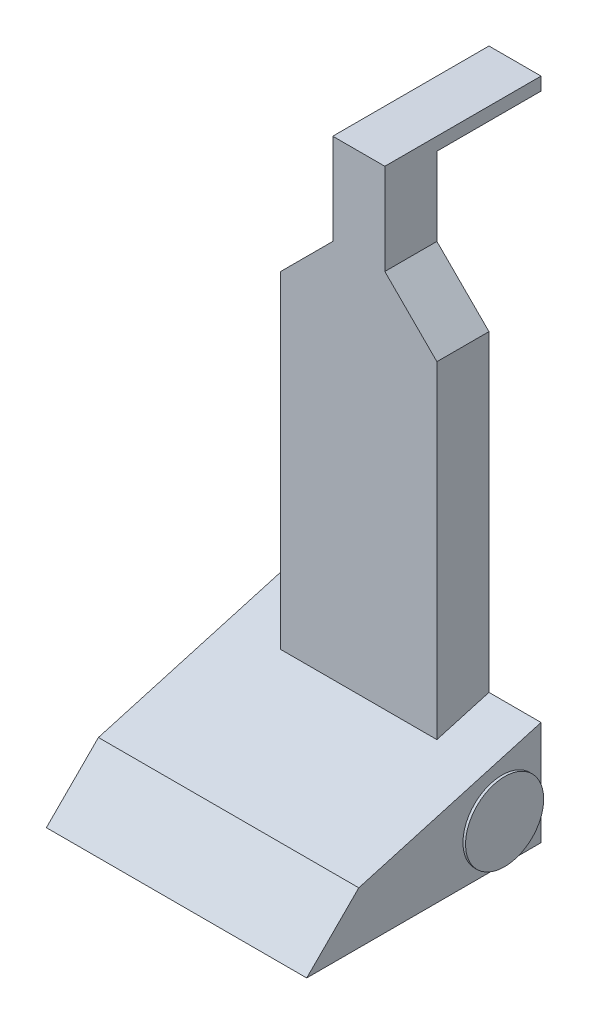
ISO-10303-21;
HEADER;
FILE_DESCRIPTION(('STEP AP214'),'2;1');
FILE_NAME('part.step','',(''),(''),'','','');
FILE_SCHEMA(('AUTOMOTIVE_DESIGN { 1 0 10303 214 1 1 1 1 }'));
ENDSEC;
DATA;
#1=APPLICATION_CONTEXT('core data for automotive mechanical design processes');
#2=APPLICATION_PROTOCOL_DEFINITION('international standard','automotive_design',2000,#1);
#3=PRODUCT_CONTEXT('',#1,'mechanical');
#4=PRODUCT('Part','Part','',(#3));
#5=PRODUCT_RELATED_PRODUCT_CATEGORY('part','',(#4));
#6=PRODUCT_DEFINITION_FORMATION('','',#4);
#7=PRODUCT_DEFINITION_CONTEXT('part definition',#1,'design');
#8=PRODUCT_DEFINITION('design','',#6,#7);
#9=PRODUCT_DEFINITION_SHAPE('','',#8);
#10=(LENGTH_UNIT() NAMED_UNIT(*) SI_UNIT(.MILLI.,.METRE.));
#11=(NAMED_UNIT(*) PLANE_ANGLE_UNIT() SI_UNIT($,.RADIAN.));
#12=(NAMED_UNIT(*) SI_UNIT($,.STERADIAN.) SOLID_ANGLE_UNIT());
#13=UNCERTAINTY_MEASURE_WITH_UNIT(LENGTH_MEASURE(1.E-05),#10,'distance_accuracy_value','');
#14=(GEOMETRIC_REPRESENTATION_CONTEXT(3) GLOBAL_UNCERTAINTY_ASSIGNED_CONTEXT((#13)) GLOBAL_UNIT_ASSIGNED_CONTEXT((#10,
#11,#12)) REPRESENTATION_CONTEXT('',''));
#15=CARTESIAN_POINT('',(0.,0.,0.));
#16=DIRECTION('',(0.,0.,1.));
#17=DIRECTION('',(1.,0.,0.));
#18=AXIS2_PLACEMENT_3D('',#15,#16,#17);
#19=CARTESIAN_POINT('',(-51.,15.,15.));
#20=DIRECTION('',(1.,0.,0.));
#21=DIRECTION('',(0.,0.,-1.));
#22=AXIS2_PLACEMENT_3D('',#19,#20,#21);
#23=CYLINDRICAL_SURFACE('',#22,15.);
#24=CARTESIAN_POINT('',(-51.,15.,15.));
#25=DIRECTION('',(-1.,0.,0.));
#26=DIRECTION('',(0.,0.,1.));
#27=AXIS2_PLACEMENT_3D('',#24,#25,#26);
#28=CIRCLE('',#27,15.);
#29=CARTESIAN_POINT('',(-51.,15.,30.));
#30=VERTEX_POINT('',#29);
#31=EDGE_CURVE('E11',#30,#30,#28,.T.);
#32=ORIENTED_EDGE('',*,*,#31,.F.);
#33=EDGE_LOOP('',(#32));
#34=FACE_BOUND('',#33,.T.);
#35=CARTESIAN_POINT('',(-50.,15.,15.));
#36=DIRECTION('',(-1.,0.,0.));
#37=DIRECTION('',(0.,0.,1.));
#38=AXIS2_PLACEMENT_3D('',#35,#36,#37);
#39=CIRCLE('',#38,15.);
#40=CARTESIAN_POINT('',(-50.,15.,30.));
#41=VERTEX_POINT('',#40);
#42=EDGE_CURVE('E45',#41,#41,#39,.T.);
#43=ORIENTED_EDGE('',*,*,#42,.T.);
#44=EDGE_LOOP('',(#43));
#45=FACE_BOUND('',#44,.T.);
#46=ADVANCED_FACE('F39',(#34,#45),#23,.T.);
#47=CARTESIAN_POINT('',(-51.,15.,15.));
#48=DIRECTION('',(-1.,0.,0.));
#49=DIRECTION('',(0.,0.,1.));
#50=AXIS2_PLACEMENT_3D('',#47,#48,#49);
#51=PLANE('',#50);
#52=ORIENTED_EDGE('',*,*,#31,.T.);
#53=EDGE_LOOP('',(#52));
#54=FACE_BOUND('',#53,.T.);
#55=ADVANCED_FACE('F54',(#54),#51,.T.);
#56=CARTESIAN_POINT('',(-50.,15.,15.));
#57=DIRECTION('',(-1.,0.,0.));
#58=DIRECTION('',(0.,0.,1.));
#59=AXIS2_PLACEMENT_3D('',#56,#57,#58);
#60=PLANE('',#59);
#61=ORIENTED_EDGE('',*,*,#42,.F.);
#62=EDGE_LOOP('',(#61));
#63=FACE_BOUND('',#62,.T.);
#64=ADVANCED_FACE('F52',(#63),#60,.F.);
#65=CLOSED_SHELL('',(#46,#55,#64));
#66=MANIFOLD_SOLID_BREP('B2',#65);
#67=CARTESIAN_POINT('',(51.,15.,15.));
#68=DIRECTION('',(-1.,0.,0.));
#69=DIRECTION('',(0.,0.,1.));
#70=AXIS2_PLACEMENT_3D('',#67,#68,#69);
#71=CYLINDRICAL_SURFACE('',#70,15.);
#72=CARTESIAN_POINT('',(51.,15.,15.));
#73=DIRECTION('',(1.,0.,0.));
#74=DIRECTION('',(0.,0.,-1.));
#75=AXIS2_PLACEMENT_3D('',#72,#73,#74);
#76=CIRCLE('',#75,15.);
#77=CARTESIAN_POINT('',(51.,15.,0.));
#78=VERTEX_POINT('',#77);
#79=EDGE_CURVE('E38',#78,#78,#76,.T.);
#80=ORIENTED_EDGE('',*,*,#79,.F.);
#81=EDGE_LOOP('',(#80));
#82=FACE_BOUND('',#81,.T.);
#83=CARTESIAN_POINT('',(50.,15.,15.));
#84=DIRECTION('',(1.,0.,0.));
#85=DIRECTION('',(0.,0.,-1.));
#86=AXIS2_PLACEMENT_3D('',#83,#84,#85);
#87=CIRCLE('',#86,15.);
#88=CARTESIAN_POINT('',(50.,15.,0.));
#89=VERTEX_POINT('',#88);
#90=EDGE_CURVE('E94',#89,#89,#87,.T.);
#91=ORIENTED_EDGE('',*,*,#90,.T.);
#92=EDGE_LOOP('',(#91));
#93=FACE_BOUND('',#92,.T.);
#94=ADVANCED_FACE('F88',(#82,#93),#71,.T.);
#95=CARTESIAN_POINT('',(51.,15.,15.));
#96=DIRECTION('',(1.,0.,0.));
#97=DIRECTION('',(0.,0.,-1.));
#98=AXIS2_PLACEMENT_3D('',#95,#96,#97);
#99=PLANE('',#98);
#100=ORIENTED_EDGE('',*,*,#79,.T.);
#101=EDGE_LOOP('',(#100));
#102=FACE_BOUND('',#101,.T.);
#103=ADVANCED_FACE('F103',(#102),#99,.T.);
#104=CARTESIAN_POINT('',(50.,15.,15.));
#105=DIRECTION('',(1.,0.,0.));
#106=DIRECTION('',(0.,0.,-1.));
#107=AXIS2_PLACEMENT_3D('',#104,#105,#106);
#108=PLANE('',#107);
#109=ORIENTED_EDGE('',*,*,#90,.F.);
#110=EDGE_LOOP('',(#109));
#111=FACE_BOUND('',#110,.T.);
#112=ADVANCED_FACE('F101',(#111),#108,.F.);
#113=CLOSED_SHELL('',(#94,#103,#112));
#114=MANIFOLD_SOLID_BREP('B6',#113);
#115=CARTESIAN_POINT('',(50.,20.0000000000001,70.));
#116=DIRECTION('',(0.,-0.961523947640823,-0.274721127897377));
#117=DIRECTION('',(0.,0.274721127897377,-0.961523947640823));
#118=AXIS2_PLACEMENT_3D('',#115,#116,#117);
#119=PLANE('',#118);
#120=DIRECTION('',(0.,-0.274721127897377,0.961523947640824));
#121=VECTOR('',#120,1.);
#122=CARTESIAN_POINT('',(-30.,20.0000000000001,70.));
#123=LINE('',#122,#121);
#124=CARTESIAN_POINT('',(-30.,40.0000000000001,0.));
#125=VERTEX_POINT('',#124);
#126=CARTESIAN_POINT('',(-30.,34.2857142857143,20.));
#127=VERTEX_POINT('',#126);
#128=EDGE_CURVE('E301',#125,#127,#123,.T.);
#129=ORIENTED_EDGE('',*,*,#128,.F.);
#130=DIRECTION('',(-1.,0.,0.));
#131=VECTOR('',#130,1.);
#132=CARTESIAN_POINT('',(50.,40.,0.));
#133=LINE('',#132,#131);
#134=CARTESIAN_POINT('',(-50.,40.,0.));
#135=VERTEX_POINT('',#134);
#136=EDGE_CURVE('E327',#125,#135,#133,.T.);
#137=ORIENTED_EDGE('',*,*,#136,.T.);
#138=DIRECTION('',(0.,-0.274721127897377,0.961523947640823));
#139=VECTOR('',#138,1.);
#140=CARTESIAN_POINT('',(-50.,20.0000000000001,70.));
#141=LINE('',#140,#139);
#142=CARTESIAN_POINT('',(-50.,20.0000000000001,70.));
#143=VERTEX_POINT('',#142);
#144=EDGE_CURVE('E307',#135,#143,#141,.T.);
#145=ORIENTED_EDGE('',*,*,#144,.T.);
#146=DIRECTION('',(-1.,0.,0.));
#147=VECTOR('',#146,1.);
#148=CARTESIAN_POINT('',(50.,20.0000000000001,70.));
#149=LINE('',#148,#147);
#150=CARTESIAN_POINT('',(50.,20.0000000000001,70.));
#151=VERTEX_POINT('',#150);
#152=EDGE_CURVE('E336',#151,#143,#149,.T.);
#153=ORIENTED_EDGE('',*,*,#152,.F.);
#154=DIRECTION('',(0.,-0.274721127897377,0.961523947640823));
#155=VECTOR('',#154,1.);
#156=CARTESIAN_POINT('',(50.,20.0000000000001,70.));
#157=LINE('',#156,#155);
#158=CARTESIAN_POINT('',(50.,40.,0.));
#159=VERTEX_POINT('',#158);
#160=EDGE_CURVE('E318',#159,#151,#157,.T.);
#161=ORIENTED_EDGE('',*,*,#160,.F.);
#162=CARTESIAN_POINT('',(30.,40.,0.));
#163=VERTEX_POINT('',#162);
#164=EDGE_CURVE('E328',#159,#163,#133,.T.);
#165=ORIENTED_EDGE('',*,*,#164,.T.);
#166=DIRECTION('',(0.,0.274721127897377,-0.961523947640824));
#167=VECTOR('',#166,1.);
#168=CARTESIAN_POINT('',(29.9999999999999,20.0000000000001,70.));
#169=LINE('',#168,#167);
#170=CARTESIAN_POINT('',(30.,34.2857142857143,20.));
#171=VERTEX_POINT('',#170);
#172=EDGE_CURVE('E298',#171,#163,#169,.T.);
#173=ORIENTED_EDGE('',*,*,#172,.F.);
#174=DIRECTION('',(1.,0.,0.));
#175=VECTOR('',#174,1.);
#176=CARTESIAN_POINT('',(50.,34.2857142857143,20.));
#177=LINE('',#176,#175);
#178=EDGE_CURVE('E304',#127,#171,#177,.T.);
#179=ORIENTED_EDGE('',*,*,#178,.F.);
#180=EDGE_LOOP('',(#129,#137,#145,#153,#161,#165,#173,#179));
#181=FACE_BOUND('',#180,.T.);
#182=ADVANCED_FACE('F128',(#181),#119,.F.);
#183=CARTESIAN_POINT('',(50.,0.,90.));
#184=DIRECTION('',(0.,-0.707106781186546,-0.707106781186549));
#185=DIRECTION('',(0.,0.707106781186549,-0.707106781186546));
#186=AXIS2_PLACEMENT_3D('',#183,#184,#185);
#187=PLANE('',#186);
#188=DIRECTION('',(0.,-0.707106781186549,0.707106781186546));
#189=VECTOR('',#188,1.);
#190=CARTESIAN_POINT('',(-50.,0.,90.));
#191=LINE('',#190,#189);
#192=CARTESIAN_POINT('',(-50.,0.,90.));
#193=VERTEX_POINT('',#192);
#194=EDGE_CURVE('E310',#143,#193,#191,.T.);
#195=ORIENTED_EDGE('',*,*,#194,.T.);
#196=DIRECTION('',(-1.,0.,0.));
#197=VECTOR('',#196,1.);
#198=CARTESIAN_POINT('',(50.,0.,90.));
#199=LINE('',#198,#197);
#200=CARTESIAN_POINT('',(50.,0.,90.));
#201=VERTEX_POINT('',#200);
#202=EDGE_CURVE('E333',#201,#193,#199,.T.);
#203=ORIENTED_EDGE('',*,*,#202,.F.);
#204=DIRECTION('',(0.,-0.707106781186549,0.707106781186546));
#205=VECTOR('',#204,1.);
#206=CARTESIAN_POINT('',(50.,0.,90.));
#207=LINE('',#206,#205);
#208=EDGE_CURVE('E321',#151,#201,#207,.T.);
#209=ORIENTED_EDGE('',*,*,#208,.F.);
#210=ORIENTED_EDGE('',*,*,#152,.T.);
#211=EDGE_LOOP('',(#195,#203,#209,#210));
#212=FACE_BOUND('',#211,.T.);
#213=ADVANCED_FACE('F391',(#212),#187,.F.);
#214=CARTESIAN_POINT('',(50.,0.,0.));
#215=DIRECTION('',(0.,1.,0.));
#216=DIRECTION('',(0.,0.,1.));
#217=AXIS2_PLACEMENT_3D('',#214,#215,#216);
#218=PLANE('',#217);
#219=DIRECTION('',(0.,0.,-1.));
#220=VECTOR('',#219,1.);
#221=CARTESIAN_POINT('',(-50.,0.,0.));
#222=LINE('',#221,#220);
#223=CARTESIAN_POINT('',(-50.,0.,0.));
#224=VERTEX_POINT('',#223);
#225=EDGE_CURVE('E312',#193,#224,#222,.T.);
#226=ORIENTED_EDGE('',*,*,#225,.T.);
#227=DIRECTION('',(-1.,0.,0.));
#228=VECTOR('',#227,1.);
#229=CARTESIAN_POINT('',(50.,0.,0.));
#230=LINE('',#229,#228);
#231=CARTESIAN_POINT('',(50.,0.,0.));
#232=VERTEX_POINT('',#231);
#233=EDGE_CURVE('E331',#232,#224,#230,.T.);
#234=ORIENTED_EDGE('',*,*,#233,.F.);
#235=DIRECTION('',(0.,0.,-1.));
#236=VECTOR('',#235,1.);
#237=CARTESIAN_POINT('',(50.,0.,0.));
#238=LINE('',#237,#236);
#239=EDGE_CURVE('E323',#201,#232,#238,.T.);
#240=ORIENTED_EDGE('',*,*,#239,.F.);
#241=ORIENTED_EDGE('',*,*,#202,.T.);
#242=EDGE_LOOP('',(#226,#234,#240,#241));
#243=FACE_BOUND('',#242,.T.);
#244=ADVANCED_FACE('F387',(#243),#218,.F.);
#245=CARTESIAN_POINT('',(50.,40.,0.));
#246=DIRECTION('',(0.,0.,1.));
#247=DIRECTION('',(0.,-1.,0.));
#248=AXIS2_PLACEMENT_3D('',#245,#246,#247);
#249=PLANE('',#248);
#250=DIRECTION('',(0.,-1.,0.));
#251=VECTOR('',#250,1.);
#252=CARTESIAN_POINT('',(-30.,180.,0.));
#253=LINE('',#252,#251);
#254=CARTESIAN_POINT('',(-30.,160.,0.));
#255=VERTEX_POINT('',#254);
#256=EDGE_CURVE('E290',#255,#125,#253,.T.);
#257=ORIENTED_EDGE('',*,*,#256,.F.);
#258=DIRECTION('',(0.707106781186548,0.707106781186547,0.));
#259=VECTOR('',#258,1.);
#260=CARTESIAN_POINT('',(-9.99999999999991,180.,0.));
#261=LINE('',#260,#259);
#262=CARTESIAN_POINT('',(-9.9999999999999,180.,0.));
#263=VERTEX_POINT('',#262);
#264=EDGE_CURVE('E136',#255,#263,#261,.T.);
#265=ORIENTED_EDGE('',*,*,#264,.T.);
#266=DIRECTION('',(0.,-1.,0.));
#267=VECTOR('',#266,1.);
#268=CARTESIAN_POINT('',(-9.9999999999999,210.,0.));
#269=LINE('',#268,#267);
#270=CARTESIAN_POINT('',(-10.0000000000001,210.,0.));
#271=VERTEX_POINT('',#270);
#272=EDGE_CURVE('E286',#271,#263,#269,.T.);
#273=ORIENTED_EDGE('',*,*,#272,.F.);
#274=DIRECTION('',(-1.,0.,0.));
#275=VECTOR('',#274,1.);
#276=CARTESIAN_POINT('',(9.9999999999999,210.,0.));
#277=LINE('',#276,#275);
#278=CARTESIAN_POINT('',(9.9999999999999,210.,0.));
#279=VERTEX_POINT('',#278);
#280=EDGE_CURVE('E254',#279,#271,#277,.T.);
#281=ORIENTED_EDGE('',*,*,#280,.F.);
#282=DIRECTION('',(0.,-1.,0.));
#283=VECTOR('',#282,1.);
#284=CARTESIAN_POINT('',(9.9999999999999,210.,0.));
#285=LINE('',#284,#283);
#286=CARTESIAN_POINT('',(9.9999999999999,180.,0.));
#287=VERTEX_POINT('',#286);
#288=EDGE_CURVE('E238',#279,#287,#285,.T.);
#289=ORIENTED_EDGE('',*,*,#288,.T.);
#290=DIRECTION('',(0.707106781186548,-0.707106781186547,0.));
#291=VECTOR('',#290,1.);
#292=CARTESIAN_POINT('',(9.9999999999999,180.,0.));
#293=LINE('',#292,#291);
#294=CARTESIAN_POINT('',(30.,160.,0.));
#295=VERTEX_POINT('',#294);
#296=EDGE_CURVE('E144',#287,#295,#293,.T.);
#297=ORIENTED_EDGE('',*,*,#296,.T.);
#298=DIRECTION('',(0.,-1.,0.));
#299=VECTOR('',#298,1.);
#300=CARTESIAN_POINT('',(30.,180.,0.));
#301=LINE('',#300,#299);
#302=EDGE_CURVE('E292',#295,#163,#301,.T.);
#303=ORIENTED_EDGE('',*,*,#302,.T.);
#304=ORIENTED_EDGE('',*,*,#164,.F.);
#305=DIRECTION('',(0.,1.,0.));
#306=VECTOR('',#305,1.);
#307=CARTESIAN_POINT('',(50.,40.,0.));
#308=LINE('',#307,#306);
#309=EDGE_CURVE('E325',#232,#159,#308,.T.);
#310=ORIENTED_EDGE('',*,*,#309,.F.);
#311=ORIENTED_EDGE('',*,*,#233,.T.);
#312=DIRECTION('',(0.,1.,0.));
#313=VECTOR('',#312,1.);
#314=CARTESIAN_POINT('',(-50.,40.,0.));
#315=LINE('',#314,#313);
#316=EDGE_CURVE('E315',#224,#135,#315,.T.);
#317=ORIENTED_EDGE('',*,*,#316,.T.);
#318=ORIENTED_EDGE('',*,*,#136,.F.);
#319=EDGE_LOOP('',(#257,#265,#273,#281,#289,#297,#303,#304,#310,#311,#317,#318));
#320=FACE_BOUND('',#319,.T.);
#321=ADVANCED_FACE('F353',(#320),#249,.F.);
#322=CARTESIAN_POINT('',(50.,40.,0.));
#323=DIRECTION('',(-1.,0.,0.));
#324=DIRECTION('',(0.,0.,1.));
#325=AXIS2_PLACEMENT_3D('',#322,#323,#324);
#326=PLANE('',#325);
#327=ORIENTED_EDGE('',*,*,#160,.T.);
#328=ORIENTED_EDGE('',*,*,#208,.T.);
#329=ORIENTED_EDGE('',*,*,#239,.T.);
#330=ORIENTED_EDGE('',*,*,#309,.T.);
#331=EDGE_LOOP('',(#327,#328,#329,#330));
#332=FACE_BOUND('',#331,.T.);
#333=ADVANCED_FACE('F381',(#332),#326,.F.);
#334=CARTESIAN_POINT('',(-50.,40.,0.));
#335=DIRECTION('',(-1.,0.,0.));
#336=DIRECTION('',(0.,0.,1.));
#337=AXIS2_PLACEMENT_3D('',#334,#335,#336);
#338=PLANE('',#337);
#339=ORIENTED_EDGE('',*,*,#144,.F.);
#340=ORIENTED_EDGE('',*,*,#316,.F.);
#341=ORIENTED_EDGE('',*,*,#225,.F.);
#342=ORIENTED_EDGE('',*,*,#194,.F.);
#343=EDGE_LOOP('',(#339,#340,#341,#342));
#344=FACE_BOUND('',#343,.T.);
#345=ADVANCED_FACE('F389',(#344),#338,.T.);
#346=CARTESIAN_POINT('',(-30.,180.,20.));
#347=DIRECTION('',(0.,0.,-1.));
#348=DIRECTION('',(-1.,0.,0.));
#349=AXIS2_PLACEMENT_3D('',#346,#347,#348);
#350=PLANE('',#349);
#351=DIRECTION('',(-0.707106781186548,0.707106781186547,0.));
#352=VECTOR('',#351,1.);
#353=CARTESIAN_POINT('',(9.9999999999999,180.,20.));
#354=LINE('',#353,#352);
#355=CARTESIAN_POINT('',(30.,160.,20.));
#356=VERTEX_POINT('',#355);
#357=CARTESIAN_POINT('',(9.9999999999999,180.,20.));
#358=VERTEX_POINT('',#357);
#359=EDGE_CURVE('E343',#356,#358,#354,.T.);
#360=ORIENTED_EDGE('',*,*,#359,.T.);
#361=DIRECTION('',(0.,-1.,0.));
#362=VECTOR('',#361,1.);
#363=CARTESIAN_POINT('',(9.9999999999999,210.,20.));
#364=LINE('',#363,#362);
#365=CARTESIAN_POINT('',(9.9999999999999,215.,20.));
#366=VERTEX_POINT('',#365);
#367=EDGE_CURVE('E257',#366,#358,#364,.T.);
#368=ORIENTED_EDGE('',*,*,#367,.F.);
#369=DIRECTION('',(1.,0.,0.));
#370=VECTOR('',#369,1.);
#371=CARTESIAN_POINT('',(9.9999999999999,215.,20.));
#372=LINE('',#371,#370);
#373=CARTESIAN_POINT('',(-10.0000000000001,215.,20.));
#374=VERTEX_POINT('',#373);
#375=EDGE_CURVE('E259',#374,#366,#372,.T.);
#376=ORIENTED_EDGE('',*,*,#375,.F.);
#377=DIRECTION('',(0.,-1.,0.));
#378=VECTOR('',#377,1.);
#379=CARTESIAN_POINT('',(-9.9999999999999,210.,20.));
#380=LINE('',#379,#378);
#381=CARTESIAN_POINT('',(-9.9999999999999,180.,20.));
#382=VERTEX_POINT('',#381);
#383=EDGE_CURVE('E284',#374,#382,#380,.T.);
#384=ORIENTED_EDGE('',*,*,#383,.T.);
#385=DIRECTION('',(-0.707106781186548,-0.707106781186547,0.));
#386=VECTOR('',#385,1.);
#387=CARTESIAN_POINT('',(-9.99999999999991,180.,20.));
#388=LINE('',#387,#386);
#389=CARTESIAN_POINT('',(-30.,160.,20.));
#390=VERTEX_POINT('',#389);
#391=EDGE_CURVE('E345',#382,#390,#388,.T.);
#392=ORIENTED_EDGE('',*,*,#391,.T.);
#393=DIRECTION('',(0.,-1.,0.));
#394=VECTOR('',#393,1.);
#395=CARTESIAN_POINT('',(-30.,180.,20.));
#396=LINE('',#395,#394);
#397=EDGE_CURVE('E296',#390,#127,#396,.T.);
#398=ORIENTED_EDGE('',*,*,#397,.T.);
#399=ORIENTED_EDGE('',*,*,#178,.T.);
#400=DIRECTION('',(0.,-1.,0.));
#401=VECTOR('',#400,1.);
#402=CARTESIAN_POINT('',(30.,180.,20.));
#403=LINE('',#402,#401);
#404=EDGE_CURVE('E294',#356,#171,#403,.T.);
#405=ORIENTED_EDGE('',*,*,#404,.F.);
#406=EDGE_LOOP('',(#360,#368,#376,#384,#392,#398,#399,#405));
#407=FACE_BOUND('',#406,.T.);
#408=ADVANCED_FACE('F357',(#407),#350,.F.);
#409=CARTESIAN_POINT('',(-30.,180.,0.));
#410=DIRECTION('',(1.,0.,0.));
#411=DIRECTION('',(0.,0.,-1.));
#412=AXIS2_PLACEMENT_3D('',#409,#410,#411);
#413=PLANE('',#412);
#414=ORIENTED_EDGE('',*,*,#397,.F.);
#415=DIRECTION('',(0.,0.,-1.));
#416=VECTOR('',#415,1.);
#417=CARTESIAN_POINT('',(-30.,160.,0.));
#418=LINE('',#417,#416);
#419=EDGE_CURVE('E152',#390,#255,#418,.T.);
#420=ORIENTED_EDGE('',*,*,#419,.T.);
#421=ORIENTED_EDGE('',*,*,#256,.T.);
#422=ORIENTED_EDGE('',*,*,#128,.T.);
#423=EDGE_LOOP('',(#414,#420,#421,#422));
#424=FACE_BOUND('',#423,.T.);
#425=ADVANCED_FACE('F360',(#424),#413,.F.);
#426=CARTESIAN_POINT('',(30.,180.,0.));
#427=DIRECTION('',(-1.,0.,0.));
#428=DIRECTION('',(0.,0.,1.));
#429=AXIS2_PLACEMENT_3D('',#426,#427,#428);
#430=PLANE('',#429);
#431=ORIENTED_EDGE('',*,*,#302,.F.);
#432=DIRECTION('',(0.,0.,1.));
#433=VECTOR('',#432,1.);
#434=CARTESIAN_POINT('',(30.,160.,20.));
#435=LINE('',#434,#433);
#436=EDGE_CURVE('E86',#295,#356,#435,.T.);
#437=ORIENTED_EDGE('',*,*,#436,.T.);
#438=ORIENTED_EDGE('',*,*,#404,.T.);
#439=ORIENTED_EDGE('',*,*,#172,.T.);
#440=EDGE_LOOP('',(#431,#437,#438,#439));
#441=FACE_BOUND('',#440,.T.);
#442=ADVANCED_FACE('F375',(#441),#430,.F.);
#443=CARTESIAN_POINT('',(-9.99999999999991,180.,0.));
#444=DIRECTION('',(-0.707106781186547,0.707106781186548,0.));
#445=DIRECTION('',(-0.707106781186548,-0.707106781186547,0.));
#446=AXIS2_PLACEMENT_3D('',#443,#444,#445);
#447=PLANE('',#446);
#448=ORIENTED_EDGE('',*,*,#264,.F.);
#449=ORIENTED_EDGE('',*,*,#419,.F.);
#450=ORIENTED_EDGE('',*,*,#391,.F.);
#451=DIRECTION('',(0.,0.,1.));
#452=VECTOR('',#451,1.);
#453=CARTESIAN_POINT('',(-9.99999999999991,180.,20.));
#454=LINE('',#453,#452);
#455=EDGE_CURVE('E340',#263,#382,#454,.T.);
#456=ORIENTED_EDGE('',*,*,#455,.F.);
#457=EDGE_LOOP('',(#448,#449,#450,#456));
#458=FACE_BOUND('',#457,.T.);
#459=ADVANCED_FACE('F363',(#458),#447,.T.);
#460=CARTESIAN_POINT('',(9.9999999999999,180.,0.));
#461=DIRECTION('',(0.707106781186547,0.707106781186548,0.));
#462=DIRECTION('',(-0.707106781186548,0.707106781186547,0.));
#463=AXIS2_PLACEMENT_3D('',#460,#461,#462);
#464=PLANE('',#463);
#465=ORIENTED_EDGE('',*,*,#359,.F.);
#466=ORIENTED_EDGE('',*,*,#436,.F.);
#467=ORIENTED_EDGE('',*,*,#296,.F.);
#468=DIRECTION('',(0.,0.,-1.));
#469=VECTOR('',#468,1.);
#470=CARTESIAN_POINT('',(9.9999999999999,180.,0.));
#471=LINE('',#470,#469);
#472=EDGE_CURVE('E283',#358,#287,#471,.T.);
#473=ORIENTED_EDGE('',*,*,#472,.F.);
#474=EDGE_LOOP('',(#465,#466,#467,#473));
#475=FACE_BOUND('',#474,.T.);
#476=ADVANCED_FACE('F374',(#475),#464,.T.);
#477=CARTESIAN_POINT('',(9.9999999999999,210.,20.));
#478=DIRECTION('',(-1.,0.,0.));
#479=DIRECTION('',(0.,0.,1.));
#480=AXIS2_PLACEMENT_3D('',#477,#478,#479);
#481=PLANE('',#480);
#482=ORIENTED_EDGE('',*,*,#472,.T.);
#483=ORIENTED_EDGE('',*,*,#288,.F.);
#484=DIRECTION('',(0.,0.,-1.));
#485=VECTOR('',#484,1.);
#486=CARTESIAN_POINT('',(9.9999999999999,210.,20.));
#487=LINE('',#486,#485);
#488=CARTESIAN_POINT('',(9.99999999999989,210.,-40.));
#489=VERTEX_POINT('',#488);
#490=EDGE_CURVE('E231',#279,#489,#487,.T.);
#491=ORIENTED_EDGE('',*,*,#490,.T.);
#492=DIRECTION('',(0.,-1.,0.));
#493=VECTOR('',#492,1.);
#494=CARTESIAN_POINT('',(9.99999999999989,215.,-40.));
#495=LINE('',#494,#493);
#496=CARTESIAN_POINT('',(9.99999999999989,215.,-40.));
#497=VERTEX_POINT('',#496);
#498=EDGE_CURVE('E237',#497,#489,#495,.T.);
#499=ORIENTED_EDGE('',*,*,#498,.F.);
#500=DIRECTION('',(0.,0.,-1.));
#501=VECTOR('',#500,1.);
#502=CARTESIAN_POINT('',(9.9999999999999,215.,20.));
#503=LINE('',#502,#501);
#504=EDGE_CURVE('E269',#366,#497,#503,.T.);
#505=ORIENTED_EDGE('',*,*,#504,.F.);
#506=ORIENTED_EDGE('',*,*,#367,.T.);
#507=EDGE_LOOP('',(#482,#483,#491,#499,#505,#506));
#508=FACE_BOUND('',#507,.T.);
#509=ADVANCED_FACE('F234',(#508),#481,.F.);
#510=CARTESIAN_POINT('',(-9.9999999999999,210.,20.));
#511=DIRECTION('',(1.,0.,0.));
#512=DIRECTION('',(0.,0.,-1.));
#513=AXIS2_PLACEMENT_3D('',#510,#511,#512);
#514=PLANE('',#513);
#515=ORIENTED_EDGE('',*,*,#455,.T.);
#516=ORIENTED_EDGE('',*,*,#383,.F.);
#517=DIRECTION('',(0.,0.,1.));
#518=VECTOR('',#517,1.);
#519=CARTESIAN_POINT('',(-10.0000000000001,215.,20.));
#520=LINE('',#519,#518);
#521=CARTESIAN_POINT('',(-10.0000000000001,215.,-40.));
#522=VERTEX_POINT('',#521);
#523=EDGE_CURVE('E272',#522,#374,#520,.T.);
#524=ORIENTED_EDGE('',*,*,#523,.F.);
#525=DIRECTION('',(0.,-1.,0.));
#526=VECTOR('',#525,1.);
#527=CARTESIAN_POINT('',(-10.0000000000001,215.,-40.));
#528=LINE('',#527,#526);
#529=CARTESIAN_POINT('',(-10.0000000000001,210.,-40.));
#530=VERTEX_POINT('',#529);
#531=EDGE_CURVE('E255',#522,#530,#528,.T.);
#532=ORIENTED_EDGE('',*,*,#531,.T.);
#533=DIRECTION('',(0.,0.,1.));
#534=VECTOR('',#533,1.);
#535=CARTESIAN_POINT('',(-10.0000000000001,210.,20.));
#536=LINE('',#535,#534);
#537=EDGE_CURVE('E246',#530,#271,#536,.T.);
#538=ORIENTED_EDGE('',*,*,#537,.T.);
#539=ORIENTED_EDGE('',*,*,#272,.T.);
#540=EDGE_LOOP('',(#515,#516,#524,#532,#538,#539));
#541=FACE_BOUND('',#540,.T.);
#542=ADVANCED_FACE('F355',(#541),#514,.F.);
#543=CARTESIAN_POINT('',(9.99999999999989,210.,-40.));
#544=DIRECTION('',(0.,1.,0.));
#545=DIRECTION('',(0.,0.,1.));
#546=AXIS2_PLACEMENT_3D('',#543,#544,#545);
#547=PLANE('',#546);
#548=ORIENTED_EDGE('',*,*,#490,.F.);
#549=ORIENTED_EDGE('',*,*,#280,.T.);
#550=ORIENTED_EDGE('',*,*,#537,.F.);
#551=DIRECTION('',(-1.,0.,0.));
#552=VECTOR('',#551,1.);
#553=CARTESIAN_POINT('',(9.99999999999989,210.,-40.));
#554=LINE('',#553,#552);
#555=EDGE_CURVE('E241',#489,#530,#554,.T.);
#556=ORIENTED_EDGE('',*,*,#555,.F.);
#557=EDGE_LOOP('',(#548,#549,#550,#556));
#558=FACE_BOUND('',#557,.T.);
#559=ADVANCED_FACE('F244',(#558),#547,.F.);
#560=CARTESIAN_POINT('',(9.99999999999989,215.,-40.));
#561=DIRECTION('',(0.,0.,1.));
#562=DIRECTION('',(1.,0.,0.));
#563=AXIS2_PLACEMENT_3D('',#560,#561,#562);
#564=PLANE('',#563);
#565=ORIENTED_EDGE('',*,*,#555,.T.);
#566=ORIENTED_EDGE('',*,*,#531,.F.);
#567=DIRECTION('',(-1.,0.,0.));
#568=VECTOR('',#567,1.);
#569=CARTESIAN_POINT('',(9.99999999999989,215.,-40.));
#570=LINE('',#569,#568);
#571=EDGE_CURVE('E252',#497,#522,#570,.T.);
#572=ORIENTED_EDGE('',*,*,#571,.F.);
#573=ORIENTED_EDGE('',*,*,#498,.T.);
#574=EDGE_LOOP('',(#565,#566,#572,#573));
#575=FACE_BOUND('',#574,.T.);
#576=ADVANCED_FACE('F251',(#575),#564,.F.);
#577=CARTESIAN_POINT('',(9.99999999999989,215.,-40.));
#578=DIRECTION('',(0.,1.,0.));
#579=DIRECTION('',(0.,0.,1.));
#580=AXIS2_PLACEMENT_3D('',#577,#578,#579);
#581=PLANE('',#580);
#582=ORIENTED_EDGE('',*,*,#504,.T.);
#583=ORIENTED_EDGE('',*,*,#571,.T.);
#584=ORIENTED_EDGE('',*,*,#523,.T.);
#585=ORIENTED_EDGE('',*,*,#375,.T.);
#586=EDGE_LOOP('',(#582,#583,#584,#585));
#587=FACE_BOUND('',#586,.T.);
#588=ADVANCED_FACE('F277',(#587),#581,.T.);
#589=CLOSED_SHELL('',(#182,#213,#244,#321,#333,#345,#408,#425,#442,#459,#476,#509,#542,#559,
#576,#588));
#590=MANIFOLD_SOLID_BREP('B33',#589);
#591=ADVANCED_BREP_SHAPE_REPRESENTATION('',(#18,#66,#114,#590),#14);
#592=SHAPE_DEFINITION_REPRESENTATION(#9,#591);
ENDSEC;
END-ISO-10303-21;
